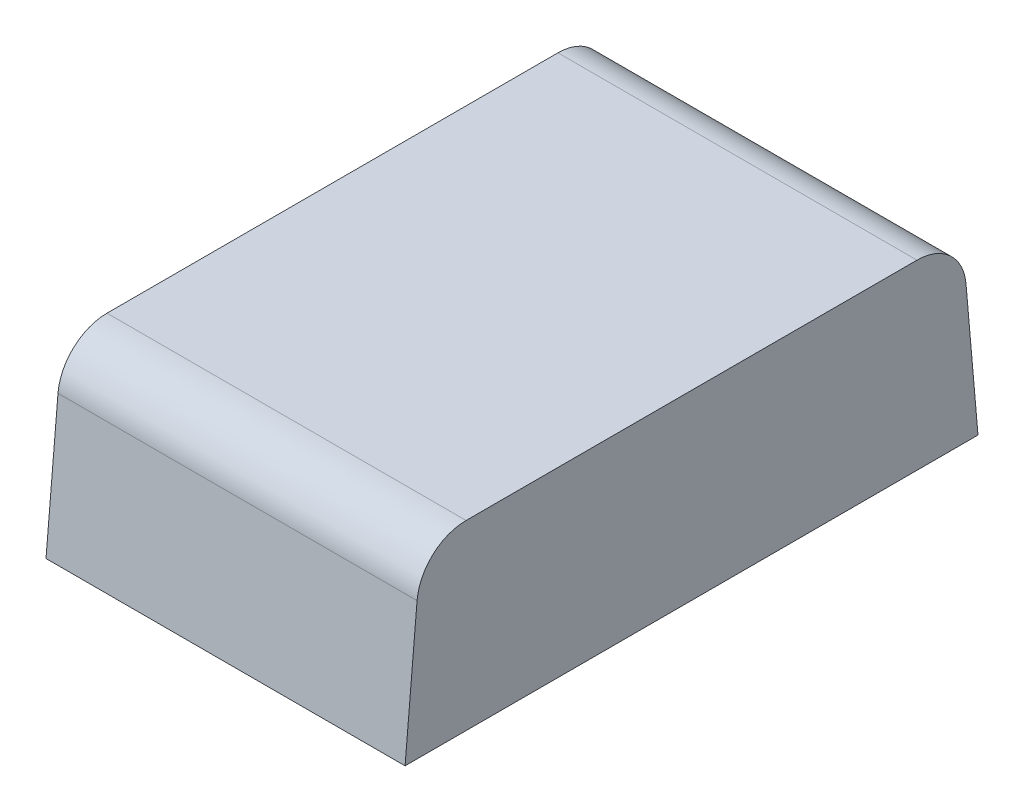
ISO-10303-21;
HEADER;
FILE_DESCRIPTION(('STEP AP214'),'2;1');
FILE_NAME('part.step','',(''),(''),'','','');
FILE_SCHEMA(('AUTOMOTIVE_DESIGN { 1 0 10303 214 1 1 1 1 }'));
ENDSEC;
DATA;
#1=APPLICATION_CONTEXT('core data for automotive mechanical design processes');
#2=APPLICATION_PROTOCOL_DEFINITION('international standard','automotive_design',2000,#1);
#3=PRODUCT_CONTEXT('',#1,'mechanical');
#4=PRODUCT('Part','Part','',(#3));
#5=PRODUCT_RELATED_PRODUCT_CATEGORY('part','',(#4));
#6=PRODUCT_DEFINITION_FORMATION('','',#4);
#7=PRODUCT_DEFINITION_CONTEXT('part definition',#1,'design');
#8=PRODUCT_DEFINITION('design','',#6,#7);
#9=PRODUCT_DEFINITION_SHAPE('','',#8);
#10=(LENGTH_UNIT() NAMED_UNIT(*) SI_UNIT(.MILLI.,.METRE.));
#11=(NAMED_UNIT(*) PLANE_ANGLE_UNIT() SI_UNIT($,.RADIAN.));
#12=(NAMED_UNIT(*) SI_UNIT($,.STERADIAN.) SOLID_ANGLE_UNIT());
#13=UNCERTAINTY_MEASURE_WITH_UNIT(LENGTH_MEASURE(1.E-05),#10,'distance_accuracy_value','');
#14=(GEOMETRIC_REPRESENTATION_CONTEXT(3) GLOBAL_UNCERTAINTY_ASSIGNED_CONTEXT((#13)) GLOBAL_UNIT_ASSIGNED_CONTEXT((#10,
#11,#12)) REPRESENTATION_CONTEXT('',''));
#15=CARTESIAN_POINT('',(0.,0.,0.));
#16=DIRECTION('',(0.,0.,1.));
#17=DIRECTION('',(1.,0.,0.));
#18=AXIS2_PLACEMENT_3D('',#15,#16,#17);
#19=CARTESIAN_POINT('',(1.255,1.3,-31.0166331174));
#20=DIRECTION('',(1.,0.,0.));
#21=DIRECTION('',(0.,0.,-1.));
#22=AXIS2_PLACEMENT_3D('',#19,#20,#21);
#23=CYLINDRICAL_SURFACE('',#22,0.0999999999999998);
#24=CARTESIAN_POINT('',(1.255,1.3,-31.0166331174));
#25=DIRECTION('',(1.,0.,0.));
#26=DIRECTION('',(0.,0.,-1.));
#27=AXIS2_PLACEMENT_3D('',#24,#25,#26);
#28=CIRCLE('',#27,0.0999999999999998);
#29=CARTESIAN_POINT('',(1.255,1.30871557427365,-30.9170136475899));
#30=VERTEX_POINT('',#29);
#31=CARTESIAN_POINT('',(1.255,1.4,-31.0166331174));
#32=VERTEX_POINT('',#31);
#33=EDGE_CURVE('E21',#30,#32,#28,.F.);
#34=ORIENTED_EDGE('',*,*,#33,.F.);
#35=DIRECTION('',(-1.,0.,0.));
#36=VECTOR('',#35,1.);
#37=CARTESIAN_POINT('',(1.62,1.308715574275,-30.91701364759));
#38=LINE('',#37,#36);
#39=CARTESIAN_POINT('',(1.985,1.30871557427458,-30.9170136475934));
#40=VERTEX_POINT('',#39);
#41=EDGE_CURVE('E61',#40,#30,#38,.T.);
#42=ORIENTED_EDGE('',*,*,#41,.F.);
#43=CARTESIAN_POINT('',(1.985,1.3,-31.0166331174));
#44=DIRECTION('',(1.,0.,0.));
#45=DIRECTION('',(0.,0.,-1.));
#46=AXIS2_PLACEMENT_3D('',#43,#44,#45);
#47=CIRCLE('',#46,0.0999999999999998);
#48=CARTESIAN_POINT('',(1.985,1.4,-31.0166331174));
#49=VERTEX_POINT('',#48);
#50=EDGE_CURVE('E84',#49,#40,#47,.T.);
#51=ORIENTED_EDGE('',*,*,#50,.F.);
#52=DIRECTION('',(1.,0.,0.));
#53=VECTOR('',#52,1.);
#54=CARTESIAN_POINT('',(1.62,1.4,-31.0166331174));
#55=LINE('',#54,#53);
#56=EDGE_CURVE('E74',#32,#49,#55,.T.);
#57=ORIENTED_EDGE('',*,*,#56,.F.);
#58=EDGE_LOOP('',(#34,#42,#51,#57));
#59=FACE_BOUND('',#58,.T.);
#60=ADVANCED_FACE('F17',(#59),#23,.T.);
#61=CARTESIAN_POINT('',(1.985,1.3,-31.9333668826));
#62=DIRECTION('',(-1.,0.,0.));
#63=DIRECTION('',(0.,0.,1.));
#64=AXIS2_PLACEMENT_3D('',#61,#62,#63);
#65=CYLINDRICAL_SURFACE('',#64,0.0999999999999998);
#66=CARTESIAN_POINT('',(1.985,1.3,-31.9333668826));
#67=DIRECTION('',(-1.,0.,0.));
#68=DIRECTION('',(0.,0.,1.));
#69=AXIS2_PLACEMENT_3D('',#66,#67,#68);
#70=CIRCLE('',#69,0.0999999999999998);
#71=CARTESIAN_POINT('',(1.985,1.30871557427469,-32.0329863524061));
#72=VERTEX_POINT('',#71);
#73=CARTESIAN_POINT('',(1.985,1.4,-31.9333668826));
#74=VERTEX_POINT('',#73);
#75=EDGE_CURVE('E97',#72,#74,#70,.F.);
#76=ORIENTED_EDGE('',*,*,#75,.F.);
#77=DIRECTION('',(1.,0.,0.));
#78=VECTOR('',#77,1.);
#79=CARTESIAN_POINT('',(1.62,1.308715574275,-32.03298635241));
#80=LINE('',#79,#78);
#81=CARTESIAN_POINT('',(1.255,1.30871557427458,-32.0329863524065));
#82=VERTEX_POINT('',#81);
#83=EDGE_CURVE('E79',#82,#72,#80,.T.);
#84=ORIENTED_EDGE('',*,*,#83,.F.);
#85=CARTESIAN_POINT('',(1.255,1.3,-31.9333668826));
#86=DIRECTION('',(-1.,0.,0.));
#87=DIRECTION('',(0.,0.,1.));
#88=AXIS2_PLACEMENT_3D('',#85,#86,#87);
#89=CIRCLE('',#88,0.0999999999999998);
#90=CARTESIAN_POINT('',(1.255,1.4,-31.9333668826));
#91=VERTEX_POINT('',#90);
#92=EDGE_CURVE('E105',#91,#82,#89,.T.);
#93=ORIENTED_EDGE('',*,*,#92,.F.);
#94=DIRECTION('',(-1.,0.,0.));
#95=VECTOR('',#94,1.);
#96=CARTESIAN_POINT('',(1.62,1.4,-31.9333668826));
#97=LINE('',#96,#95);
#98=EDGE_CURVE('E111',#74,#91,#97,.T.);
#99=ORIENTED_EDGE('',*,*,#98,.F.);
#100=EDGE_LOOP('',(#76,#84,#93,#99));
#101=FACE_BOUND('',#100,.T.);
#102=ADVANCED_FACE('F130',(#101),#65,.T.);
#103=CARTESIAN_POINT('',(1.985,1.4,-31.9333668826));
#104=DIRECTION('',(0.,1.,0.));
#105=DIRECTION('',(-1.,0.,0.));
#106=AXIS2_PLACEMENT_3D('',#103,#104,#105);
#107=PLANE('',#106);
#108=ORIENTED_EDGE('',*,*,#98,.T.);
#109=DIRECTION('',(0.,0.,-1.));
#110=VECTOR('',#109,1.);
#111=CARTESIAN_POINT('',(1.255,1.4,-31.475));
#112=LINE('',#111,#110);
#113=EDGE_CURVE('E78',#32,#91,#112,.T.);
#114=ORIENTED_EDGE('',*,*,#113,.F.);
#115=ORIENTED_EDGE('',*,*,#56,.T.);
#116=DIRECTION('',(0.,0.,1.));
#117=VECTOR('',#116,1.);
#118=CARTESIAN_POINT('',(1.985,1.4,-31.475));
#119=LINE('',#118,#117);
#120=EDGE_CURVE('E100',#74,#49,#119,.T.);
#121=ORIENTED_EDGE('',*,*,#120,.F.);
#122=EDGE_LOOP('',(#108,#114,#115,#121));
#123=FACE_BOUND('',#122,.T.);
#124=ADVANCED_FACE('F133',(#123),#107,.T.);
#125=CARTESIAN_POINT('',(1.985,1.03,-32.0573708055));
#126=DIRECTION('',(0.,0.0871557427222329,-0.99619469809397));
#127=DIRECTION('',(-1.,0.,0.));
#128=AXIS2_PLACEMENT_3D('',#125,#126,#127);
#129=PLANE('',#128);
#130=DIRECTION('',(-1.,0.,0.));
#131=VECTOR('',#130,1.);
#132=CARTESIAN_POINT('',(1.62,1.03,-32.0573708055));
#133=LINE('',#132,#131);
#134=CARTESIAN_POINT('',(1.985,1.03,-32.0573708055));
#135=VERTEX_POINT('',#134);
#136=CARTESIAN_POINT('',(1.255,1.03,-32.0573708055));
#137=VERTEX_POINT('',#136);
#138=EDGE_CURVE('E94',#135,#137,#133,.T.);
#139=ORIENTED_EDGE('',*,*,#138,.T.);
#140=DIRECTION('',(0.,-0.996194698091809,-0.0871557427469325));
#141=VECTOR('',#140,1.);
#142=CARTESIAN_POINT('',(1.255,1.3087155742748,-32.0329863524031));
#143=LINE('',#142,#141);
#144=EDGE_CURVE('E70',#82,#137,#143,.T.);
#145=ORIENTED_EDGE('',*,*,#144,.F.);
#146=ORIENTED_EDGE('',*,*,#83,.T.);
#147=DIRECTION('',(0.,0.996194698091546,0.0871557427499353));
#148=VECTOR('',#147,1.);
#149=CARTESIAN_POINT('',(1.985,1.03,-32.0573708055));
#150=LINE('',#149,#148);
#151=EDGE_CURVE('E101',#135,#72,#150,.T.);
#152=ORIENTED_EDGE('',*,*,#151,.F.);
#153=EDGE_LOOP('',(#139,#145,#146,#152));
#154=FACE_BOUND('',#153,.T.);
#155=ADVANCED_FACE('F128',(#154),#129,.T.);
#156=CARTESIAN_POINT('',(1.255,1.03,-32.0573708055));
#157=DIRECTION('',(-1.,0.,0.));
#158=DIRECTION('',(0.,0.,1.));
#159=AXIS2_PLACEMENT_3D('',#156,#157,#158);
#160=PLANE('',#159);
#161=DIRECTION('',(0.,0.,1.));
#162=VECTOR('',#161,1.);
#163=CARTESIAN_POINT('',(1.255,1.03,-31.475));
#164=LINE('',#163,#162);
#165=CARTESIAN_POINT('',(1.255,1.03,-30.8926291945));
#166=VERTEX_POINT('',#165);
#167=EDGE_CURVE('E83',#137,#166,#164,.T.);
#168=ORIENTED_EDGE('',*,*,#167,.T.);
#169=DIRECTION('',(0.,-0.996194698093973,0.087155742722196));
#170=VECTOR('',#169,1.);
#171=CARTESIAN_POINT('',(1.255,1.1693577871375,-30.904821421045));
#172=LINE('',#171,#170);
#173=EDGE_CURVE('E66',#30,#166,#172,.T.);
#174=ORIENTED_EDGE('',*,*,#173,.F.);
#175=ORIENTED_EDGE('',*,*,#33,.T.);
#176=ORIENTED_EDGE('',*,*,#113,.T.);
#177=ORIENTED_EDGE('',*,*,#92,.T.);
#178=ORIENTED_EDGE('',*,*,#144,.T.);
#179=EDGE_LOOP('',(#168,#174,#175,#176,#177,#178));
#180=FACE_BOUND('',#179,.T.);
#181=ADVANCED_FACE('F81',(#180),#160,.T.);
#182=CARTESIAN_POINT('',(1.255,1.03,-30.8926291945));
#183=DIRECTION('',(0.,0.087155742722196,0.996194698093973));
#184=DIRECTION('',(1.,0.,0.));
#185=AXIS2_PLACEMENT_3D('',#182,#183,#184);
#186=PLANE('',#185);
#187=DIRECTION('',(1.,0.,0.));
#188=VECTOR('',#187,1.);
#189=CARTESIAN_POINT('',(1.62,1.03,-30.8926291945));
#190=LINE('',#189,#188);
#191=CARTESIAN_POINT('',(1.985,1.03,-30.8926291945));
#192=VERTEX_POINT('',#191);
#193=EDGE_CURVE('E27',#166,#192,#190,.T.);
#194=ORIENTED_EDGE('',*,*,#193,.T.);
#195=DIRECTION('',(0.,-0.996194698091809,0.0871557427469325));
#196=VECTOR('',#195,1.);
#197=CARTESIAN_POINT('',(1.985,1.3087155742748,-30.917013647597));
#198=LINE('',#197,#196);
#199=EDGE_CURVE('E35',#40,#192,#198,.T.);
#200=ORIENTED_EDGE('',*,*,#199,.F.);
#201=ORIENTED_EDGE('',*,*,#41,.T.);
#202=ORIENTED_EDGE('',*,*,#173,.T.);
#203=EDGE_LOOP('',(#194,#200,#201,#202));
#204=FACE_BOUND('',#203,.T.);
#205=ADVANCED_FACE('F64',(#204),#186,.T.);
#206=CARTESIAN_POINT('',(1.985,1.03,-30.8926291945));
#207=DIRECTION('',(1.,0.,0.));
#208=DIRECTION('',(0.,0.,-1.));
#209=AXIS2_PLACEMENT_3D('',#206,#207,#208);
#210=PLANE('',#209);
#211=ORIENTED_EDGE('',*,*,#75,.T.);
#212=ORIENTED_EDGE('',*,*,#120,.T.);
#213=ORIENTED_EDGE('',*,*,#50,.T.);
#214=ORIENTED_EDGE('',*,*,#199,.T.);
#215=DIRECTION('',(0.,0.,-1.));
#216=VECTOR('',#215,1.);
#217=CARTESIAN_POINT('',(1.985,1.03,-31.475));
#218=LINE('',#217,#216);
#219=EDGE_CURVE('E11',#192,#135,#218,.T.);
#220=ORIENTED_EDGE('',*,*,#219,.T.);
#221=ORIENTED_EDGE('',*,*,#151,.T.);
#222=EDGE_LOOP('',(#211,#212,#213,#214,#220,#221));
#223=FACE_BOUND('',#222,.T.);
#224=ADVANCED_FACE('F120',(#223),#210,.T.);
#225=CARTESIAN_POINT('',(1.985,1.03,-32.0573708055));
#226=DIRECTION('',(0.,1.,0.));
#227=DIRECTION('',(-1.,0.,0.));
#228=AXIS2_PLACEMENT_3D('',#225,#226,#227);
#229=PLANE('',#228);
#230=ORIENTED_EDGE('',*,*,#193,.F.);
#231=ORIENTED_EDGE('',*,*,#167,.F.);
#232=ORIENTED_EDGE('',*,*,#138,.F.);
#233=ORIENTED_EDGE('',*,*,#219,.F.);
#234=EDGE_LOOP('',(#230,#231,#232,#233));
#235=FACE_BOUND('',#234,.T.);
#236=ADVANCED_FACE('F19',(#235),#229,.F.);
#237=CLOSED_SHELL('',(#60,#102,#124,#155,#181,#205,#224,#236));
#238=MANIFOLD_SOLID_BREP('B1',#237);
#239=ADVANCED_BREP_SHAPE_REPRESENTATION('',(#18,#238),#14);
#240=SHAPE_DEFINITION_REPRESENTATION(#9,#239);
ENDSEC;
END-ISO-10303-21;
